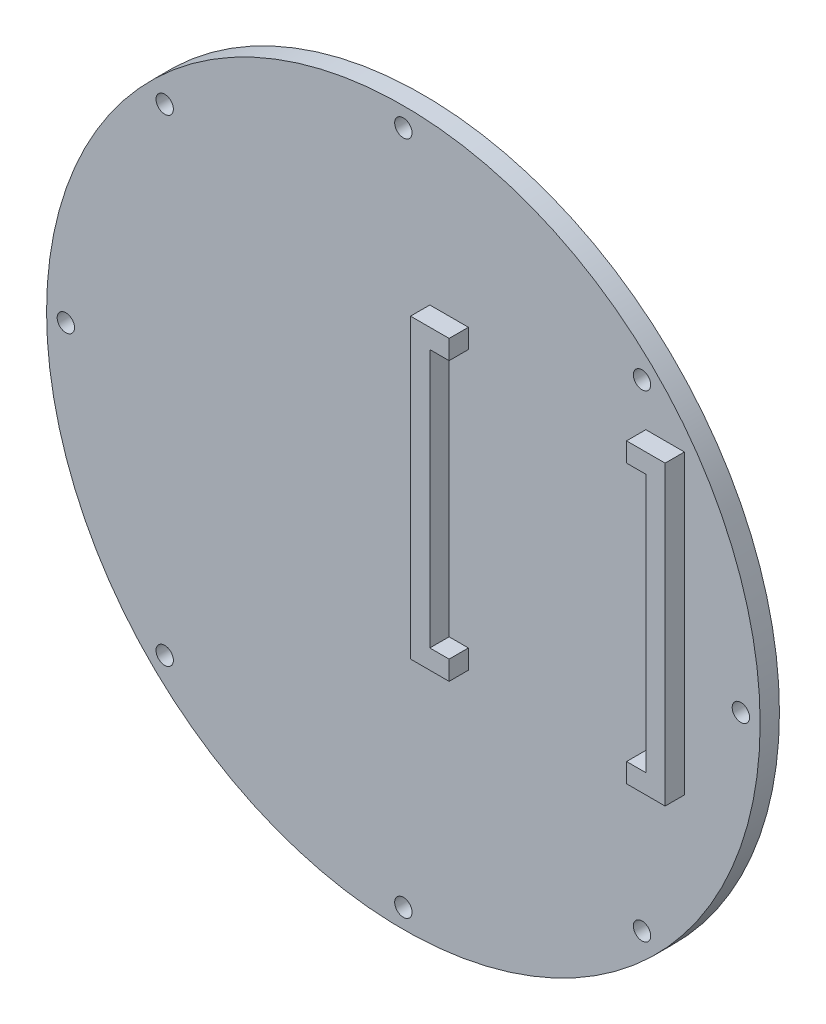
ISO-10303-21;
HEADER;
FILE_DESCRIPTION(('STEP AP214'),'2;1');
FILE_NAME('part.step','',(''),(''),'','','');
FILE_SCHEMA(('AUTOMOTIVE_DESIGN { 1 0 10303 214 1 1 1 1 }'));
ENDSEC;
DATA;
#1=APPLICATION_CONTEXT('core data for automotive mechanical design processes');
#2=APPLICATION_PROTOCOL_DEFINITION('international standard','automotive_design',2000,#1);
#3=PRODUCT_CONTEXT('',#1,'mechanical');
#4=PRODUCT('Part','Part','',(#3));
#5=PRODUCT_RELATED_PRODUCT_CATEGORY('part','',(#4));
#6=PRODUCT_DEFINITION_FORMATION('','',#4);
#7=PRODUCT_DEFINITION_CONTEXT('part definition',#1,'design');
#8=PRODUCT_DEFINITION('design','',#6,#7);
#9=PRODUCT_DEFINITION_SHAPE('','',#8);
#10=(LENGTH_UNIT() NAMED_UNIT(*) SI_UNIT(.MILLI.,.METRE.));
#11=(NAMED_UNIT(*) PLANE_ANGLE_UNIT() SI_UNIT($,.RADIAN.));
#12=(NAMED_UNIT(*) SI_UNIT($,.STERADIAN.) SOLID_ANGLE_UNIT());
#13=UNCERTAINTY_MEASURE_WITH_UNIT(LENGTH_MEASURE(1.E-05),#10,'distance_accuracy_value','');
#14=(GEOMETRIC_REPRESENTATION_CONTEXT(3) GLOBAL_UNCERTAINTY_ASSIGNED_CONTEXT((#13)) GLOBAL_UNIT_ASSIGNED_CONTEXT((#10,
#11,#12)) REPRESENTATION_CONTEXT('',''));
#15=CARTESIAN_POINT('',(0.,0.,0.));
#16=DIRECTION('',(0.,0.,1.));
#17=DIRECTION('',(1.,0.,0.));
#18=AXIS2_PLACEMENT_3D('',#15,#16,#17);
#19=CARTESIAN_POINT('',(0.,0.,5.));
#20=DIRECTION('',(0.,0.,1.));
#21=DIRECTION('',(1.,0.,0.));
#22=AXIS2_PLACEMENT_3D('',#19,#20,#21);
#23=PLANE('',#22);
#24=CARTESIAN_POINT('',(87.5,0.,5.));
#25=DIRECTION('',(0.,0.,1.));
#26=DIRECTION('',(1.,0.,0.));
#27=AXIS2_PLACEMENT_3D('',#24,#25,#26);
#28=CIRCLE('',#27,2.25);
#29=CARTESIAN_POINT('',(89.75,0.,5.));
#30=VERTEX_POINT('',#29);
#31=EDGE_CURVE('E387',#30,#30,#28,.F.);
#32=ORIENTED_EDGE('',*,*,#31,.T.);
#33=EDGE_LOOP('',(#32));
#34=FACE_BOUND('',#33,.T.);
#35=CARTESIAN_POINT('',(61.8718433538228,61.871843353823,5.));
#36=DIRECTION('',(0.,0.,1.));
#37=DIRECTION('',(1.,0.,0.));
#38=AXIS2_PLACEMENT_3D('',#35,#36,#37);
#39=CIRCLE('',#38,2.24999999999999);
#40=CARTESIAN_POINT('',(64.1218433538228,61.871843353823,5.));
#41=VERTEX_POINT('',#40);
#42=EDGE_CURVE('E402',#41,#41,#39,.F.);
#43=ORIENTED_EDGE('',*,*,#42,.T.);
#44=EDGE_LOOP('',(#43));
#45=FACE_BOUND('',#44,.T.);
#46=CARTESIAN_POINT('',(-3.05504617148774E-13,87.5,5.));
#47=DIRECTION('',(0.,0.,1.));
#48=DIRECTION('',(1.,0.,0.));
#49=AXIS2_PLACEMENT_3D('',#46,#47,#48);
#50=CIRCLE('',#49,2.24999999999999);
#51=CARTESIAN_POINT('',(2.24999999999969,87.5,5.));
#52=VERTEX_POINT('',#51);
#53=EDGE_CURVE('E410',#52,#52,#50,.F.);
#54=ORIENTED_EDGE('',*,*,#53,.T.);
#55=EDGE_LOOP('',(#54));
#56=FACE_BOUND('',#55,.T.);
#57=CARTESIAN_POINT('',(-61.8718433538232,61.8718433538226,5.));
#58=DIRECTION('',(0.,0.,1.));
#59=DIRECTION('',(1.,0.,0.));
#60=AXIS2_PLACEMENT_3D('',#57,#58,#59);
#61=CIRCLE('',#60,2.25);
#62=CARTESIAN_POINT('',(-59.6218433538232,61.8718433538226,5.));
#63=VERTEX_POINT('',#62);
#64=EDGE_CURVE('E418',#63,#63,#61,.F.);
#65=ORIENTED_EDGE('',*,*,#64,.T.);
#66=EDGE_LOOP('',(#65));
#67=FACE_BOUND('',#66,.T.);
#68=CARTESIAN_POINT('',(-87.5,-6.11009234297548E-13,5.));
#69=DIRECTION('',(0.,0.,1.));
#70=DIRECTION('',(1.,0.,0.));
#71=AXIS2_PLACEMENT_3D('',#68,#69,#70);
#72=CIRCLE('',#71,2.24999999999999);
#73=CARTESIAN_POINT('',(-85.25,-6.11009234297548E-13,5.));
#74=VERTEX_POINT('',#73);
#75=EDGE_CURVE('E426',#74,#74,#72,.F.);
#76=ORIENTED_EDGE('',*,*,#75,.T.);
#77=EDGE_LOOP('',(#76));
#78=FACE_BOUND('',#77,.T.);
#79=CARTESIAN_POINT('',(-61.8718433538224,-61.8718433538234,5.));
#80=DIRECTION('',(0.,0.,1.));
#81=DIRECTION('',(1.,0.,0.));
#82=AXIS2_PLACEMENT_3D('',#79,#80,#81);
#83=CIRCLE('',#82,2.24999999999999);
#84=CARTESIAN_POINT('',(-59.6218433538224,-61.8718433538234,5.));
#85=VERTEX_POINT('',#84);
#86=EDGE_CURVE('E434',#85,#85,#83,.F.);
#87=ORIENTED_EDGE('',*,*,#86,.T.);
#88=EDGE_LOOP('',(#87));
#89=FACE_BOUND('',#88,.T.);
#90=CARTESIAN_POINT('',(9.16513851446323E-13,-87.5,5.));
#91=DIRECTION('',(0.,0.,1.));
#92=DIRECTION('',(1.,0.,0.));
#93=AXIS2_PLACEMENT_3D('',#90,#91,#92);
#94=CIRCLE('',#93,2.24999999999999);
#95=CARTESIAN_POINT('',(2.25000000000091,-87.5,5.));
#96=VERTEX_POINT('',#95);
#97=EDGE_CURVE('E442',#96,#96,#94,.F.);
#98=ORIENTED_EDGE('',*,*,#97,.T.);
#99=EDGE_LOOP('',(#98));
#100=FACE_BOUND('',#99,.T.);
#101=CARTESIAN_POINT('',(61.8718433538237,-61.8718433538221,5.));
#102=DIRECTION('',(0.,0.,1.));
#103=DIRECTION('',(1.,0.,0.));
#104=AXIS2_PLACEMENT_3D('',#101,#102,#103);
#105=CIRCLE('',#104,2.24999999999999);
#106=CARTESIAN_POINT('',(64.1218433538236,-61.8718433538221,5.));
#107=VERTEX_POINT('',#106);
#108=EDGE_CURVE('E450',#107,#107,#105,.F.);
#109=ORIENTED_EDGE('',*,*,#108,.T.);
#110=EDGE_LOOP('',(#109));
#111=FACE_BOUND('',#110,.T.);
#112=CARTESIAN_POINT('',(0.,0.,5.));
#113=DIRECTION('',(0.,0.,1.));
#114=DIRECTION('',(1.,0.,0.));
#115=AXIS2_PLACEMENT_3D('',#112,#113,#114);
#116=CIRCLE('',#115,92.5);
#117=CARTESIAN_POINT('',(92.5,0.,5.));
#118=VERTEX_POINT('',#117);
#119=EDGE_CURVE('E11',#118,#118,#116,.T.);
#120=ORIENTED_EDGE('',*,*,#119,.T.);
#121=EDGE_LOOP('',(#120));
#122=FACE_BOUND('',#121,.T.);
#123=DIRECTION('',(1.,0.,0.));
#124=VECTOR('',#123,1.);
#125=CARTESIAN_POINT('',(72.8617691082488,-25.8415339502752,5.));
#126=LINE('',#125,#124);
#127=CARTESIAN_POINT('',(62.86176910825,-25.8415339502752,5.));
#128=VERTEX_POINT('',#127);
#129=CARTESIAN_POINT('',(72.8617691082488,-25.8415339502752,5.));
#130=VERTEX_POINT('',#129);
#131=EDGE_CURVE('E186',#128,#130,#126,.T.);
#132=ORIENTED_EDGE('',*,*,#131,.F.);
#133=DIRECTION('',(0.,-1.,0.));
#134=VECTOR('',#133,1.);
#135=CARTESIAN_POINT('',(62.86176910825,-25.8415339502752,5.));
#136=LINE('',#135,#134);
#137=CARTESIAN_POINT('',(62.86176910825,-20.8415339502752,5.));
#138=VERTEX_POINT('',#137);
#139=EDGE_CURVE('E181',#138,#128,#136,.T.);
#140=ORIENTED_EDGE('',*,*,#139,.F.);
#141=DIRECTION('',(-1.,0.,0.));
#142=VECTOR('',#141,1.);
#143=CARTESIAN_POINT('',(62.86176910825,-20.8415339502752,5.));
#144=LINE('',#143,#142);
#145=CARTESIAN_POINT('',(67.8617691082496,-20.8415339502752,5.));
#146=VERTEX_POINT('',#145);
#147=EDGE_CURVE('E197',#146,#138,#144,.T.);
#148=ORIENTED_EDGE('',*,*,#147,.F.);
#149=DIRECTION('',(0.,-1.,0.));
#150=VECTOR('',#149,1.);
#151=CARTESIAN_POINT('',(67.8617691082496,46.1584660497248,5.));
#152=LINE('',#151,#150);
#153=CARTESIAN_POINT('',(67.8617691082496,46.1584660497248,5.));
#154=VERTEX_POINT('',#153);
#155=EDGE_CURVE('E233',#154,#146,#152,.T.);
#156=ORIENTED_EDGE('',*,*,#155,.F.);
#157=DIRECTION('',(1.,0.,0.));
#158=VECTOR('',#157,1.);
#159=CARTESIAN_POINT('',(67.8617691082496,46.1584660497248,5.));
#160=LINE('',#159,#158);
#161=CARTESIAN_POINT('',(62.86176910825,46.1584660497248,5.));
#162=VERTEX_POINT('',#161);
#163=EDGE_CURVE('E230',#162,#154,#160,.T.);
#164=ORIENTED_EDGE('',*,*,#163,.F.);
#165=DIRECTION('',(0.,-1.,0.));
#166=VECTOR('',#165,1.);
#167=CARTESIAN_POINT('',(62.86176910825,46.1584660497248,5.));
#168=LINE('',#167,#166);
#169=CARTESIAN_POINT('',(62.86176910825,51.1584660497248,5.));
#170=VERTEX_POINT('',#169);
#171=EDGE_CURVE('E227',#170,#162,#168,.T.);
#172=ORIENTED_EDGE('',*,*,#171,.F.);
#173=DIRECTION('',(-1.,0.,0.));
#174=VECTOR('',#173,1.);
#175=CARTESIAN_POINT('',(62.86176910825,51.1584660497248,5.));
#176=LINE('',#175,#174);
#177=CARTESIAN_POINT('',(72.8617691082488,51.1584660497248,5.));
#178=VERTEX_POINT('',#177);
#179=EDGE_CURVE('E224',#178,#170,#176,.T.);
#180=ORIENTED_EDGE('',*,*,#179,.F.);
#181=DIRECTION('',(0.,1.,0.));
#182=VECTOR('',#181,1.);
#183=CARTESIAN_POINT('',(72.8617691082488,51.1584660497248,5.));
#184=LINE('',#183,#182);
#185=EDGE_CURVE('E221',#130,#178,#184,.T.);
#186=ORIENTED_EDGE('',*,*,#185,.F.);
#187=EDGE_LOOP('',(#132,#140,#148,#156,#164,#172,#180,#186));
#188=FACE_BOUND('',#187,.T.);
#189=DIRECTION('',(0.,1.,0.));
#190=VECTOR('',#189,1.);
#191=CARTESIAN_POINT('',(11.8617691047419,46.1584660497248,5.));
#192=LINE('',#191,#190);
#193=CARTESIAN_POINT('',(11.8617691047419,-20.8415339502752,5.));
#194=VERTEX_POINT('',#193);
#195=CARTESIAN_POINT('',(11.8617691047419,46.1584660497248,5.));
#196=VERTEX_POINT('',#195);
#197=EDGE_CURVE('E394',#194,#196,#192,.T.);
#198=ORIENTED_EDGE('',*,*,#197,.F.);
#199=DIRECTION('',(-1.,0.,0.));
#200=VECTOR('',#199,1.);
#201=CARTESIAN_POINT('',(16.8617691047416,-20.8415339502752,5.));
#202=LINE('',#201,#200);
#203=CARTESIAN_POINT('',(16.8617691047416,-20.8415339502752,5.));
#204=VERTEX_POINT('',#203);
#205=EDGE_CURVE('E178',#204,#194,#202,.T.);
#206=ORIENTED_EDGE('',*,*,#205,.F.);
#207=DIRECTION('',(0.,1.,0.));
#208=VECTOR('',#207,1.);
#209=CARTESIAN_POINT('',(16.8617691047416,-25.8415339502752,5.));
#210=LINE('',#209,#208);
#211=CARTESIAN_POINT('',(16.8617691047416,-25.8415339502752,5.));
#212=VERTEX_POINT('',#211);
#213=EDGE_CURVE('E174',#212,#204,#210,.T.);
#214=ORIENTED_EDGE('',*,*,#213,.F.);
#215=DIRECTION('',(1.,0.,0.));
#216=VECTOR('',#215,1.);
#217=CARTESIAN_POINT('',(6.86176910474275,-25.8415339502752,5.));
#218=LINE('',#217,#216);
#219=CARTESIAN_POINT('',(6.86176910474275,-25.8415339502752,5.));
#220=VERTEX_POINT('',#219);
#221=EDGE_CURVE('E485',#220,#212,#218,.T.);
#222=ORIENTED_EDGE('',*,*,#221,.F.);
#223=DIRECTION('',(0.,-1.,0.));
#224=VECTOR('',#223,1.);
#225=CARTESIAN_POINT('',(6.86176910474275,51.1584660497248,5.));
#226=LINE('',#225,#224);
#227=CARTESIAN_POINT('',(6.86176910474275,51.1584660497248,5.));
#228=VERTEX_POINT('',#227);
#229=EDGE_CURVE('E482',#228,#220,#226,.T.);
#230=ORIENTED_EDGE('',*,*,#229,.F.);
#231=DIRECTION('',(-1.,0.,0.));
#232=VECTOR('',#231,1.);
#233=CARTESIAN_POINT('',(16.8617691047416,51.1584660497248,5.));
#234=LINE('',#233,#232);
#235=CARTESIAN_POINT('',(16.8617691047416,51.1584660497248,5.));
#236=VERTEX_POINT('',#235);
#237=EDGE_CURVE('E479',#236,#228,#234,.T.);
#238=ORIENTED_EDGE('',*,*,#237,.F.);
#239=DIRECTION('',(0.,1.,0.));
#240=VECTOR('',#239,1.);
#241=CARTESIAN_POINT('',(16.8617691047416,46.1584660497248,5.));
#242=LINE('',#241,#240);
#243=CARTESIAN_POINT('',(16.8617691047416,46.1584660497248,5.));
#244=VERTEX_POINT('',#243);
#245=EDGE_CURVE('E476',#244,#236,#242,.T.);
#246=ORIENTED_EDGE('',*,*,#245,.F.);
#247=DIRECTION('',(1.,0.,0.));
#248=VECTOR('',#247,1.);
#249=CARTESIAN_POINT('',(11.8617691047419,46.1584660497248,5.));
#250=LINE('',#249,#248);
#251=EDGE_CURVE('E473',#196,#244,#250,.T.);
#252=ORIENTED_EDGE('',*,*,#251,.F.);
#253=EDGE_LOOP('',(#198,#206,#214,#222,#230,#238,#246,#252));
#254=FACE_BOUND('',#253,.T.);
#255=ADVANCED_FACE('F38',(#34,#45,#56,#67,#78,#89,#100,#111,#122,#188,#254),#23,.T.);
#256=CARTESIAN_POINT('',(0.,0.,5.));
#257=DIRECTION('',(0.,0.,-1.));
#258=DIRECTION('',(-1.,0.,0.));
#259=AXIS2_PLACEMENT_3D('',#256,#257,#258);
#260=CYLINDRICAL_SURFACE('',#259,92.5);
#261=ORIENTED_EDGE('',*,*,#119,.F.);
#262=EDGE_LOOP('',(#261));
#263=FACE_BOUND('',#262,.T.);
#264=CARTESIAN_POINT('',(0.,0.,0.));
#265=DIRECTION('',(0.,0.,1.));
#266=DIRECTION('',(1.,0.,0.));
#267=AXIS2_PLACEMENT_3D('',#264,#265,#266);
#268=CIRCLE('',#267,92.5);
#269=CARTESIAN_POINT('',(92.5,0.,0.));
#270=VERTEX_POINT('',#269);
#271=EDGE_CURVE('E42',#270,#270,#268,.T.);
#272=ORIENTED_EDGE('',*,*,#271,.T.);
#273=EDGE_LOOP('',(#272));
#274=FACE_BOUND('',#273,.T.);
#275=ADVANCED_FACE('F40',(#263,#274),#260,.T.);
#276=CARTESIAN_POINT('',(0.,0.,0.));
#277=DIRECTION('',(0.,0.,1.));
#278=DIRECTION('',(1.,0.,0.));
#279=AXIS2_PLACEMENT_3D('',#276,#277,#278);
#280=PLANE('',#279);
#281=CARTESIAN_POINT('',(87.5,0.,0.));
#282=DIRECTION('',(0.,0.,-1.));
#283=DIRECTION('',(-1.,0.,0.));
#284=AXIS2_PLACEMENT_3D('',#281,#282,#283);
#285=CIRCLE('',#284,2.25);
#286=CARTESIAN_POINT('',(85.25,0.,0.));
#287=VERTEX_POINT('',#286);
#288=EDGE_CURVE('E389',#287,#287,#285,.T.);
#289=ORIENTED_EDGE('',*,*,#288,.F.);
#290=EDGE_LOOP('',(#289));
#291=FACE_BOUND('',#290,.T.);
#292=CARTESIAN_POINT('',(61.8718433538228,61.871843353823,0.));
#293=DIRECTION('',(0.,0.,-1.));
#294=DIRECTION('',(-1.,0.,0.));
#295=AXIS2_PLACEMENT_3D('',#292,#293,#294);
#296=CIRCLE('',#295,2.24999999999999);
#297=CARTESIAN_POINT('',(59.6218433538228,61.871843353823,0.));
#298=VERTEX_POINT('',#297);
#299=EDGE_CURVE('E396',#298,#298,#296,.T.);
#300=ORIENTED_EDGE('',*,*,#299,.F.);
#301=EDGE_LOOP('',(#300));
#302=FACE_BOUND('',#301,.T.);
#303=CARTESIAN_POINT('',(-3.05504617148774E-13,87.5,0.));
#304=DIRECTION('',(0.,0.,-1.));
#305=DIRECTION('',(-1.,0.,0.));
#306=AXIS2_PLACEMENT_3D('',#303,#304,#305);
#307=CIRCLE('',#306,2.24999999999999);
#308=CARTESIAN_POINT('',(-2.2500000000003,87.5,0.));
#309=VERTEX_POINT('',#308);
#310=EDGE_CURVE('E406',#309,#309,#307,.T.);
#311=ORIENTED_EDGE('',*,*,#310,.F.);
#312=EDGE_LOOP('',(#311));
#313=FACE_BOUND('',#312,.T.);
#314=CARTESIAN_POINT('',(-61.8718433538232,61.8718433538226,0.));
#315=DIRECTION('',(0.,0.,-1.));
#316=DIRECTION('',(-1.,0.,0.));
#317=AXIS2_PLACEMENT_3D('',#314,#315,#316);
#318=CIRCLE('',#317,2.25);
#319=CARTESIAN_POINT('',(-64.1218433538232,61.8718433538226,0.));
#320=VERTEX_POINT('',#319);
#321=EDGE_CURVE('E414',#320,#320,#318,.T.);
#322=ORIENTED_EDGE('',*,*,#321,.F.);
#323=EDGE_LOOP('',(#322));
#324=FACE_BOUND('',#323,.T.);
#325=CARTESIAN_POINT('',(-87.5,-6.11009234297548E-13,0.));
#326=DIRECTION('',(0.,0.,-1.));
#327=DIRECTION('',(-1.,0.,0.));
#328=AXIS2_PLACEMENT_3D('',#325,#326,#327);
#329=CIRCLE('',#328,2.24999999999999);
#330=CARTESIAN_POINT('',(-89.75,-6.11009234297548E-13,0.));
#331=VERTEX_POINT('',#330);
#332=EDGE_CURVE('E422',#331,#331,#329,.T.);
#333=ORIENTED_EDGE('',*,*,#332,.F.);
#334=EDGE_LOOP('',(#333));
#335=FACE_BOUND('',#334,.T.);
#336=CARTESIAN_POINT('',(-61.8718433538224,-61.8718433538234,0.));
#337=DIRECTION('',(0.,0.,-1.));
#338=DIRECTION('',(-1.,0.,0.));
#339=AXIS2_PLACEMENT_3D('',#336,#337,#338);
#340=CIRCLE('',#339,2.24999999999999);
#341=CARTESIAN_POINT('',(-64.1218433538223,-61.8718433538234,0.));
#342=VERTEX_POINT('',#341);
#343=EDGE_CURVE('E430',#342,#342,#340,.T.);
#344=ORIENTED_EDGE('',*,*,#343,.F.);
#345=EDGE_LOOP('',(#344));
#346=FACE_BOUND('',#345,.T.);
#347=CARTESIAN_POINT('',(9.16513851446323E-13,-87.5,0.));
#348=DIRECTION('',(0.,0.,-1.));
#349=DIRECTION('',(-1.,0.,0.));
#350=AXIS2_PLACEMENT_3D('',#347,#348,#349);
#351=CIRCLE('',#350,2.24999999999999);
#352=CARTESIAN_POINT('',(-2.24999999999907,-87.5,0.));
#353=VERTEX_POINT('',#352);
#354=EDGE_CURVE('E438',#353,#353,#351,.T.);
#355=ORIENTED_EDGE('',*,*,#354,.F.);
#356=EDGE_LOOP('',(#355));
#357=FACE_BOUND('',#356,.T.);
#358=CARTESIAN_POINT('',(61.8718433538237,-61.8718433538221,0.));
#359=DIRECTION('',(0.,0.,-1.));
#360=DIRECTION('',(-1.,0.,0.));
#361=AXIS2_PLACEMENT_3D('',#358,#359,#360);
#362=CIRCLE('',#361,2.24999999999999);
#363=CARTESIAN_POINT('',(59.6218433538237,-61.8718433538221,0.));
#364=VERTEX_POINT('',#363);
#365=EDGE_CURVE('E446',#364,#364,#362,.T.);
#366=ORIENTED_EDGE('',*,*,#365,.F.);
#367=EDGE_LOOP('',(#366));
#368=FACE_BOUND('',#367,.T.);
#369=ORIENTED_EDGE('',*,*,#271,.F.);
#370=EDGE_LOOP('',(#369));
#371=FACE_BOUND('',#370,.T.);
#372=ADVANCED_FACE('F272',(#291,#302,#313,#324,#335,#346,#357,#368,#371),#280,.F.);
#373=CARTESIAN_POINT('',(62.86176910825,-25.8415339502752,10.));
#374=DIRECTION('',(1.,0.,0.));
#375=DIRECTION('',(0.,1.,0.));
#376=AXIS2_PLACEMENT_3D('',#373,#374,#375);
#377=PLANE('',#376);
#378=ORIENTED_EDGE('',*,*,#139,.T.);
#379=DIRECTION('',(0.,0.,-1.));
#380=VECTOR('',#379,1.);
#381=CARTESIAN_POINT('',(62.86176910825,-25.8415339502752,10.));
#382=LINE('',#381,#380);
#383=CARTESIAN_POINT('',(62.86176910825,-25.8415339502752,10.));
#384=VERTEX_POINT('',#383);
#385=EDGE_CURVE('E263',#384,#128,#382,.T.);
#386=ORIENTED_EDGE('',*,*,#385,.F.);
#387=DIRECTION('',(0.,-1.,0.));
#388=VECTOR('',#387,1.);
#389=CARTESIAN_POINT('',(62.86176910825,-25.8415339502752,10.));
#390=LINE('',#389,#388);
#391=CARTESIAN_POINT('',(62.86176910825,-20.8415339502752,10.));
#392=VERTEX_POINT('',#391);
#393=EDGE_CURVE('E192',#392,#384,#390,.T.);
#394=ORIENTED_EDGE('',*,*,#393,.F.);
#395=DIRECTION('',(0.,0.,-1.));
#396=VECTOR('',#395,1.);
#397=CARTESIAN_POINT('',(62.86176910825,-20.8415339502752,10.));
#398=LINE('',#397,#396);
#399=EDGE_CURVE('E217',#392,#138,#398,.T.);
#400=ORIENTED_EDGE('',*,*,#399,.T.);
#401=EDGE_LOOP('',(#378,#386,#394,#400));
#402=FACE_BOUND('',#401,.T.);
#403=ADVANCED_FACE('F274',(#402),#377,.F.);
#404=CARTESIAN_POINT('',(72.8617691082488,-25.8415339502752,10.));
#405=DIRECTION('',(0.,1.,0.));
#406=DIRECTION('',(0.,0.,1.));
#407=AXIS2_PLACEMENT_3D('',#404,#405,#406);
#408=PLANE('',#407);
#409=ORIENTED_EDGE('',*,*,#131,.T.);
#410=DIRECTION('',(0.,0.,-1.));
#411=VECTOR('',#410,1.);
#412=CARTESIAN_POINT('',(72.8617691082488,-25.8415339502752,10.));
#413=LINE('',#412,#411);
#414=CARTESIAN_POINT('',(72.8617691082488,-25.8415339502752,10.));
#415=VERTEX_POINT('',#414);
#416=EDGE_CURVE('E259',#415,#130,#413,.T.);
#417=ORIENTED_EDGE('',*,*,#416,.F.);
#418=DIRECTION('',(1.,0.,0.));
#419=VECTOR('',#418,1.);
#420=CARTESIAN_POINT('',(72.8617691082488,-25.8415339502752,10.));
#421=LINE('',#420,#419);
#422=EDGE_CURVE('E196',#384,#415,#421,.T.);
#423=ORIENTED_EDGE('',*,*,#422,.F.);
#424=ORIENTED_EDGE('',*,*,#385,.T.);
#425=EDGE_LOOP('',(#409,#417,#423,#424));
#426=FACE_BOUND('',#425,.T.);
#427=ADVANCED_FACE('F280',(#426),#408,.F.);
#428=CARTESIAN_POINT('',(72.8617691082488,51.1584660497248,10.));
#429=DIRECTION('',(-1.,0.,0.));
#430=DIRECTION('',(0.,0.,1.));
#431=AXIS2_PLACEMENT_3D('',#428,#429,#430);
#432=PLANE('',#431);
#433=ORIENTED_EDGE('',*,*,#185,.T.);
#434=DIRECTION('',(0.,0.,-1.));
#435=VECTOR('',#434,1.);
#436=CARTESIAN_POINT('',(72.8617691082488,51.1584660497248,10.));
#437=LINE('',#436,#435);
#438=CARTESIAN_POINT('',(72.8617691082488,51.1584660497248,10.));
#439=VERTEX_POINT('',#438);
#440=EDGE_CURVE('E255',#439,#178,#437,.T.);
#441=ORIENTED_EDGE('',*,*,#440,.F.);
#442=DIRECTION('',(0.,1.,0.));
#443=VECTOR('',#442,1.);
#444=CARTESIAN_POINT('',(72.8617691082488,51.1584660497248,10.));
#445=LINE('',#444,#443);
#446=EDGE_CURVE('E200',#415,#439,#445,.T.);
#447=ORIENTED_EDGE('',*,*,#446,.F.);
#448=ORIENTED_EDGE('',*,*,#416,.T.);
#449=EDGE_LOOP('',(#433,#441,#447,#448));
#450=FACE_BOUND('',#449,.T.);
#451=ADVANCED_FACE('F296',(#450),#432,.F.);
#452=CARTESIAN_POINT('',(62.86176910825,51.1584660497248,10.));
#453=DIRECTION('',(0.,-1.,0.));
#454=DIRECTION('',(0.,0.,-1.));
#455=AXIS2_PLACEMENT_3D('',#452,#453,#454);
#456=PLANE('',#455);
#457=ORIENTED_EDGE('',*,*,#179,.T.);
#458=DIRECTION('',(0.,0.,-1.));
#459=VECTOR('',#458,1.);
#460=CARTESIAN_POINT('',(62.86176910825,51.1584660497248,10.));
#461=LINE('',#460,#459);
#462=CARTESIAN_POINT('',(62.86176910825,51.1584660497248,10.));
#463=VERTEX_POINT('',#462);
#464=EDGE_CURVE('E251',#463,#170,#461,.T.);
#465=ORIENTED_EDGE('',*,*,#464,.F.);
#466=DIRECTION('',(-1.,0.,0.));
#467=VECTOR('',#466,1.);
#468=CARTESIAN_POINT('',(62.86176910825,51.1584660497248,10.));
#469=LINE('',#468,#467);
#470=EDGE_CURVE('E203',#439,#463,#469,.T.);
#471=ORIENTED_EDGE('',*,*,#470,.F.);
#472=ORIENTED_EDGE('',*,*,#440,.T.);
#473=EDGE_LOOP('',(#457,#465,#471,#472));
#474=FACE_BOUND('',#473,.T.);
#475=ADVANCED_FACE('F299',(#474),#456,.F.);
#476=CARTESIAN_POINT('',(62.86176910825,46.1584660497248,10.));
#477=DIRECTION('',(1.,0.,0.));
#478=DIRECTION('',(0.,1.,0.));
#479=AXIS2_PLACEMENT_3D('',#476,#477,#478);
#480=PLANE('',#479);
#481=ORIENTED_EDGE('',*,*,#171,.T.);
#482=DIRECTION('',(0.,0.,-1.));
#483=VECTOR('',#482,1.);
#484=CARTESIAN_POINT('',(62.86176910825,46.1584660497248,10.));
#485=LINE('',#484,#483);
#486=CARTESIAN_POINT('',(62.86176910825,46.1584660497248,10.));
#487=VERTEX_POINT('',#486);
#488=EDGE_CURVE('E247',#487,#162,#485,.T.);
#489=ORIENTED_EDGE('',*,*,#488,.F.);
#490=DIRECTION('',(0.,-1.,0.));
#491=VECTOR('',#490,1.);
#492=CARTESIAN_POINT('',(62.86176910825,46.1584660497248,10.));
#493=LINE('',#492,#491);
#494=EDGE_CURVE('E206',#463,#487,#493,.T.);
#495=ORIENTED_EDGE('',*,*,#494,.F.);
#496=ORIENTED_EDGE('',*,*,#464,.T.);
#497=EDGE_LOOP('',(#481,#489,#495,#496));
#498=FACE_BOUND('',#497,.T.);
#499=ADVANCED_FACE('F303',(#498),#480,.F.);
#500=CARTESIAN_POINT('',(67.8617691082496,46.1584660497248,10.));
#501=DIRECTION('',(0.,1.,0.));
#502=DIRECTION('',(-1.,0.,0.));
#503=AXIS2_PLACEMENT_3D('',#500,#501,#502);
#504=PLANE('',#503);
#505=ORIENTED_EDGE('',*,*,#163,.T.);
#506=DIRECTION('',(0.,0.,-1.));
#507=VECTOR('',#506,1.);
#508=CARTESIAN_POINT('',(67.8617691082496,46.1584660497248,10.));
#509=LINE('',#508,#507);
#510=CARTESIAN_POINT('',(67.8617691082496,46.1584660497248,10.));
#511=VERTEX_POINT('',#510);
#512=EDGE_CURVE('E243',#511,#154,#509,.T.);
#513=ORIENTED_EDGE('',*,*,#512,.F.);
#514=DIRECTION('',(1.,0.,0.));
#515=VECTOR('',#514,1.);
#516=CARTESIAN_POINT('',(67.8617691082496,46.1584660497248,10.));
#517=LINE('',#516,#515);
#518=EDGE_CURVE('E209',#487,#511,#517,.T.);
#519=ORIENTED_EDGE('',*,*,#518,.F.);
#520=ORIENTED_EDGE('',*,*,#488,.T.);
#521=EDGE_LOOP('',(#505,#513,#519,#520));
#522=FACE_BOUND('',#521,.T.);
#523=ADVANCED_FACE('F307',(#522),#504,.F.);
#524=CARTESIAN_POINT('',(67.8617691082496,46.1584660497248,10.));
#525=DIRECTION('',(1.,0.,0.));
#526=DIRECTION('',(0.,0.,-1.));
#527=AXIS2_PLACEMENT_3D('',#524,#525,#526);
#528=PLANE('',#527);
#529=ORIENTED_EDGE('',*,*,#155,.T.);
#530=DIRECTION('',(0.,0.,-1.));
#531=VECTOR('',#530,1.);
#532=CARTESIAN_POINT('',(67.8617691082496,-20.8415339502752,10.));
#533=LINE('',#532,#531);
#534=CARTESIAN_POINT('',(67.8617691082496,-20.8415339502752,10.));
#535=VERTEX_POINT('',#534);
#536=EDGE_CURVE('E62',#535,#146,#533,.T.);
#537=ORIENTED_EDGE('',*,*,#536,.F.);
#538=DIRECTION('',(0.,-1.,0.));
#539=VECTOR('',#538,1.);
#540=CARTESIAN_POINT('',(67.8617691082496,46.1584660497248,10.));
#541=LINE('',#540,#539);
#542=EDGE_CURVE('E212',#511,#535,#541,.T.);
#543=ORIENTED_EDGE('',*,*,#542,.F.);
#544=ORIENTED_EDGE('',*,*,#512,.T.);
#545=EDGE_LOOP('',(#529,#537,#543,#544));
#546=FACE_BOUND('',#545,.T.);
#547=ADVANCED_FACE('F311',(#546),#528,.F.);
#548=CARTESIAN_POINT('',(62.86176910825,-20.8415339502752,10.));
#549=DIRECTION('',(0.,-1.,0.));
#550=DIRECTION('',(1.,0.,0.));
#551=AXIS2_PLACEMENT_3D('',#548,#549,#550);
#552=PLANE('',#551);
#553=ORIENTED_EDGE('',*,*,#147,.T.);
#554=ORIENTED_EDGE('',*,*,#399,.F.);
#555=DIRECTION('',(-1.,0.,0.));
#556=VECTOR('',#555,1.);
#557=CARTESIAN_POINT('',(62.86176910825,-20.8415339502752,10.));
#558=LINE('',#557,#556);
#559=EDGE_CURVE('E215',#535,#392,#558,.T.);
#560=ORIENTED_EDGE('',*,*,#559,.F.);
#561=ORIENTED_EDGE('',*,*,#536,.T.);
#562=EDGE_LOOP('',(#553,#554,#560,#561));
#563=FACE_BOUND('',#562,.T.);
#564=ADVANCED_FACE('F315',(#563),#552,.F.);
#565=CARTESIAN_POINT('',(0.,0.,10.));
#566=DIRECTION('',(0.,0.,-1.));
#567=DIRECTION('',(-1.,0.,0.));
#568=AXIS2_PLACEMENT_3D('',#565,#566,#567);
#569=PLANE('',#568);
#570=ORIENTED_EDGE('',*,*,#393,.T.);
#571=ORIENTED_EDGE('',*,*,#422,.T.);
#572=ORIENTED_EDGE('',*,*,#446,.T.);
#573=ORIENTED_EDGE('',*,*,#470,.T.);
#574=ORIENTED_EDGE('',*,*,#494,.T.);
#575=ORIENTED_EDGE('',*,*,#518,.T.);
#576=ORIENTED_EDGE('',*,*,#542,.T.);
#577=ORIENTED_EDGE('',*,*,#559,.T.);
#578=EDGE_LOOP('',(#570,#571,#572,#573,#574,#575,#576,#577));
#579=FACE_BOUND('',#578,.T.);
#580=ADVANCED_FACE('F319',(#579),#569,.F.);
#581=CARTESIAN_POINT('',(16.8617691047416,-20.8415339502752,10.));
#582=DIRECTION('',(0.,-1.,0.));
#583=DIRECTION('',(1.,0.,0.));
#584=AXIS2_PLACEMENT_3D('',#581,#582,#583);
#585=PLANE('',#584);
#586=ORIENTED_EDGE('',*,*,#205,.T.);
#587=DIRECTION('',(0.,0.,-1.));
#588=VECTOR('',#587,1.);
#589=CARTESIAN_POINT('',(11.8617691047419,-20.8415339502752,10.));
#590=LINE('',#589,#588);
#591=CARTESIAN_POINT('',(11.8617691047419,-20.8415339502752,10.));
#592=VERTEX_POINT('',#591);
#593=EDGE_CURVE('E157',#592,#194,#590,.T.);
#594=ORIENTED_EDGE('',*,*,#593,.F.);
#595=DIRECTION('',(-1.,0.,0.));
#596=VECTOR('',#595,1.);
#597=CARTESIAN_POINT('',(16.8617691047416,-20.8415339502752,10.));
#598=LINE('',#597,#596);
#599=CARTESIAN_POINT('',(16.8617691047416,-20.8415339502752,10.));
#600=VERTEX_POINT('',#599);
#601=EDGE_CURVE('E165',#600,#592,#598,.T.);
#602=ORIENTED_EDGE('',*,*,#601,.F.);
#603=DIRECTION('',(0.,0.,-1.));
#604=VECTOR('',#603,1.);
#605=CARTESIAN_POINT('',(16.8617691047416,-20.8415339502752,10.));
#606=LINE('',#605,#604);
#607=EDGE_CURVE('E469',#600,#204,#606,.T.);
#608=ORIENTED_EDGE('',*,*,#607,.T.);
#609=EDGE_LOOP('',(#586,#594,#602,#608));
#610=FACE_BOUND('',#609,.T.);
#611=ADVANCED_FACE('F176',(#610),#585,.F.);
#612=CARTESIAN_POINT('',(11.8617691047419,46.1584660497248,10.));
#613=DIRECTION('',(-1.,0.,0.));
#614=DIRECTION('',(0.,-1.,0.));
#615=AXIS2_PLACEMENT_3D('',#612,#613,#614);
#616=PLANE('',#615);
#617=ORIENTED_EDGE('',*,*,#197,.T.);
#618=DIRECTION('',(0.,0.,-1.));
#619=VECTOR('',#618,1.);
#620=CARTESIAN_POINT('',(11.8617691047419,46.1584660497248,10.));
#621=LINE('',#620,#619);
#622=CARTESIAN_POINT('',(11.8617691047419,46.1584660497248,10.));
#623=VERTEX_POINT('',#622);
#624=EDGE_CURVE('E160',#623,#196,#621,.T.);
#625=ORIENTED_EDGE('',*,*,#624,.F.);
#626=DIRECTION('',(0.,1.,0.));
#627=VECTOR('',#626,1.);
#628=CARTESIAN_POINT('',(11.8617691047419,46.1584660497248,10.));
#629=LINE('',#628,#627);
#630=EDGE_CURVE('E153',#592,#623,#629,.T.);
#631=ORIENTED_EDGE('',*,*,#630,.F.);
#632=ORIENTED_EDGE('',*,*,#593,.T.);
#633=EDGE_LOOP('',(#617,#625,#631,#632));
#634=FACE_BOUND('',#633,.T.);
#635=ADVANCED_FACE('F155',(#634),#616,.F.);
#636=CARTESIAN_POINT('',(11.8617691047419,46.1584660497248,10.));
#637=DIRECTION('',(0.,1.,0.));
#638=DIRECTION('',(-1.,0.,0.));
#639=AXIS2_PLACEMENT_3D('',#636,#637,#638);
#640=PLANE('',#639);
#641=ORIENTED_EDGE('',*,*,#251,.T.);
#642=DIRECTION('',(0.,0.,-1.));
#643=VECTOR('',#642,1.);
#644=CARTESIAN_POINT('',(16.8617691047416,46.1584660497248,10.));
#645=LINE('',#644,#643);
#646=CARTESIAN_POINT('',(16.8617691047416,46.1584660497248,10.));
#647=VERTEX_POINT('',#646);
#648=EDGE_CURVE('E188',#647,#244,#645,.T.);
#649=ORIENTED_EDGE('',*,*,#648,.F.);
#650=DIRECTION('',(1.,0.,0.));
#651=VECTOR('',#650,1.);
#652=CARTESIAN_POINT('',(11.8617691047419,46.1584660497248,10.));
#653=LINE('',#652,#651);
#654=EDGE_CURVE('E164',#623,#647,#653,.T.);
#655=ORIENTED_EDGE('',*,*,#654,.F.);
#656=ORIENTED_EDGE('',*,*,#624,.T.);
#657=EDGE_LOOP('',(#641,#649,#655,#656));
#658=FACE_BOUND('',#657,.T.);
#659=ADVANCED_FACE('F327',(#658),#640,.F.);
#660=CARTESIAN_POINT('',(16.8617691047416,46.1584660497248,10.));
#661=DIRECTION('',(-1.,0.,0.));
#662=DIRECTION('',(0.,0.,1.));
#663=AXIS2_PLACEMENT_3D('',#660,#661,#662);
#664=PLANE('',#663);
#665=ORIENTED_EDGE('',*,*,#245,.T.);
#666=DIRECTION('',(0.,0.,-1.));
#667=VECTOR('',#666,1.);
#668=CARTESIAN_POINT('',(16.8617691047416,51.1584660497248,10.));
#669=LINE('',#668,#667);
#670=CARTESIAN_POINT('',(16.8617691047416,51.1584660497248,10.));
#671=VERTEX_POINT('',#670);
#672=EDGE_CURVE('E502',#671,#236,#669,.T.);
#673=ORIENTED_EDGE('',*,*,#672,.F.);
#674=DIRECTION('',(0.,1.,0.));
#675=VECTOR('',#674,1.);
#676=CARTESIAN_POINT('',(16.8617691047416,46.1584660497248,10.));
#677=LINE('',#676,#675);
#678=EDGE_CURVE('E456',#647,#671,#677,.T.);
#679=ORIENTED_EDGE('',*,*,#678,.F.);
#680=ORIENTED_EDGE('',*,*,#648,.T.);
#681=EDGE_LOOP('',(#665,#673,#679,#680));
#682=FACE_BOUND('',#681,.T.);
#683=ADVANCED_FACE('F330',(#682),#664,.F.);
#684=CARTESIAN_POINT('',(16.8617691047416,51.1584660497248,10.));
#685=DIRECTION('',(0.,-1.,0.));
#686=DIRECTION('',(0.,0.,-1.));
#687=AXIS2_PLACEMENT_3D('',#684,#685,#686);
#688=PLANE('',#687);
#689=ORIENTED_EDGE('',*,*,#237,.T.);
#690=DIRECTION('',(0.,0.,-1.));
#691=VECTOR('',#690,1.);
#692=CARTESIAN_POINT('',(6.86176910474275,51.1584660497248,10.));
#693=LINE('',#692,#691);
#694=CARTESIAN_POINT('',(6.86176910474275,51.1584660497248,10.));
#695=VERTEX_POINT('',#694);
#696=EDGE_CURVE('E498',#695,#228,#693,.T.);
#697=ORIENTED_EDGE('',*,*,#696,.F.);
#698=DIRECTION('',(-1.,0.,0.));
#699=VECTOR('',#698,1.);
#700=CARTESIAN_POINT('',(16.8617691047416,51.1584660497248,10.));
#701=LINE('',#700,#699);
#702=EDGE_CURVE('E459',#671,#695,#701,.T.);
#703=ORIENTED_EDGE('',*,*,#702,.F.);
#704=ORIENTED_EDGE('',*,*,#672,.T.);
#705=EDGE_LOOP('',(#689,#697,#703,#704));
#706=FACE_BOUND('',#705,.T.);
#707=ADVANCED_FACE('F334',(#706),#688,.F.);
#708=CARTESIAN_POINT('',(6.86176910474275,51.1584660497248,10.));
#709=DIRECTION('',(1.,0.,0.));
#710=DIRECTION('',(0.,0.,-1.));
#711=AXIS2_PLACEMENT_3D('',#708,#709,#710);
#712=PLANE('',#711);
#713=ORIENTED_EDGE('',*,*,#229,.T.);
#714=DIRECTION('',(0.,0.,-1.));
#715=VECTOR('',#714,1.);
#716=CARTESIAN_POINT('',(6.86176910474275,-25.8415339502752,10.));
#717=LINE('',#716,#715);
#718=CARTESIAN_POINT('',(6.86176910474275,-25.8415339502752,10.));
#719=VERTEX_POINT('',#718);
#720=EDGE_CURVE('E494',#719,#220,#717,.T.);
#721=ORIENTED_EDGE('',*,*,#720,.F.);
#722=DIRECTION('',(0.,-1.,0.));
#723=VECTOR('',#722,1.);
#724=CARTESIAN_POINT('',(6.86176910474275,51.1584660497248,10.));
#725=LINE('',#724,#723);
#726=EDGE_CURVE('E462',#695,#719,#725,.T.);
#727=ORIENTED_EDGE('',*,*,#726,.F.);
#728=ORIENTED_EDGE('',*,*,#696,.T.);
#729=EDGE_LOOP('',(#713,#721,#727,#728));
#730=FACE_BOUND('',#729,.T.);
#731=ADVANCED_FACE('F338',(#730),#712,.F.);
#732=CARTESIAN_POINT('',(6.86176910474275,-25.8415339502752,10.));
#733=DIRECTION('',(0.,1.,0.));
#734=DIRECTION('',(0.,0.,1.));
#735=AXIS2_PLACEMENT_3D('',#732,#733,#734);
#736=PLANE('',#735);
#737=ORIENTED_EDGE('',*,*,#221,.T.);
#738=DIRECTION('',(0.,0.,-1.));
#739=VECTOR('',#738,1.);
#740=CARTESIAN_POINT('',(16.8617691047416,-25.8415339502752,10.));
#741=LINE('',#740,#739);
#742=CARTESIAN_POINT('',(16.8617691047416,-25.8415339502752,10.));
#743=VERTEX_POINT('',#742);
#744=EDGE_CURVE('E54',#743,#212,#741,.T.);
#745=ORIENTED_EDGE('',*,*,#744,.F.);
#746=DIRECTION('',(1.,0.,0.));
#747=VECTOR('',#746,1.);
#748=CARTESIAN_POINT('',(6.86176910474275,-25.8415339502752,10.));
#749=LINE('',#748,#747);
#750=EDGE_CURVE('E465',#719,#743,#749,.T.);
#751=ORIENTED_EDGE('',*,*,#750,.F.);
#752=ORIENTED_EDGE('',*,*,#720,.T.);
#753=EDGE_LOOP('',(#737,#745,#751,#752));
#754=FACE_BOUND('',#753,.T.);
#755=ADVANCED_FACE('F342',(#754),#736,.F.);
#756=CARTESIAN_POINT('',(16.8617691047416,-25.8415339502752,10.));
#757=DIRECTION('',(-1.,0.,0.));
#758=DIRECTION('',(0.,-1.,0.));
#759=AXIS2_PLACEMENT_3D('',#756,#757,#758);
#760=PLANE('',#759);
#761=ORIENTED_EDGE('',*,*,#213,.T.);
#762=ORIENTED_EDGE('',*,*,#607,.F.);
#763=DIRECTION('',(0.,1.,0.));
#764=VECTOR('',#763,1.);
#765=CARTESIAN_POINT('',(16.8617691047416,-25.8415339502752,10.));
#766=LINE('',#765,#764);
#767=EDGE_CURVE('E169',#743,#600,#766,.T.);
#768=ORIENTED_EDGE('',*,*,#767,.F.);
#769=ORIENTED_EDGE('',*,*,#744,.T.);
#770=EDGE_LOOP('',(#761,#762,#768,#769));
#771=FACE_BOUND('',#770,.T.);
#772=ADVANCED_FACE('F346',(#771),#760,.F.);
#773=CARTESIAN_POINT('',(0.,0.,10.));
#774=DIRECTION('',(0.,0.,1.));
#775=DIRECTION('',(1.,0.,0.));
#776=AXIS2_PLACEMENT_3D('',#773,#774,#775);
#777=PLANE('',#776);
#778=ORIENTED_EDGE('',*,*,#601,.T.);
#779=ORIENTED_EDGE('',*,*,#630,.T.);
#780=ORIENTED_EDGE('',*,*,#654,.T.);
#781=ORIENTED_EDGE('',*,*,#678,.T.);
#782=ORIENTED_EDGE('',*,*,#702,.T.);
#783=ORIENTED_EDGE('',*,*,#726,.T.);
#784=ORIENTED_EDGE('',*,*,#750,.T.);
#785=ORIENTED_EDGE('',*,*,#767,.T.);
#786=EDGE_LOOP('',(#778,#779,#780,#781,#782,#783,#784,#785));
#787=FACE_BOUND('',#786,.T.);
#788=ADVANCED_FACE('F168',(#787),#777,.T.);
#789=CARTESIAN_POINT('',(61.8718433538237,-61.8718433538221,10.001));
#790=DIRECTION('',(0.,0.,-1.));
#791=DIRECTION('',(-1.,0.,0.));
#792=AXIS2_PLACEMENT_3D('',#789,#790,#791);
#793=CYLINDRICAL_SURFACE('',#792,2.24999999999999);
#794=ORIENTED_EDGE('',*,*,#108,.F.);
#795=EDGE_LOOP('',(#794));
#796=FACE_BOUND('',#795,.T.);
#797=ORIENTED_EDGE('',*,*,#365,.T.);
#798=EDGE_LOOP('',(#797));
#799=FACE_BOUND('',#798,.T.);
#800=ADVANCED_FACE('F352',(#796,#799),#793,.F.);
#801=CARTESIAN_POINT('',(9.16513851446323E-13,-87.5,10.001));
#802=DIRECTION('',(0.,0.,-1.));
#803=DIRECTION('',(-1.,0.,0.));
#804=AXIS2_PLACEMENT_3D('',#801,#802,#803);
#805=CYLINDRICAL_SURFACE('',#804,2.24999999999999);
#806=ORIENTED_EDGE('',*,*,#97,.F.);
#807=EDGE_LOOP('',(#806));
#808=FACE_BOUND('',#807,.T.);
#809=ORIENTED_EDGE('',*,*,#354,.T.);
#810=EDGE_LOOP('',(#809));
#811=FACE_BOUND('',#810,.T.);
#812=ADVANCED_FACE('F355',(#808,#811),#805,.F.);
#813=CARTESIAN_POINT('',(-61.8718433538224,-61.8718433538234,10.001));
#814=DIRECTION('',(0.,0.,-1.));
#815=DIRECTION('',(-1.,0.,0.));
#816=AXIS2_PLACEMENT_3D('',#813,#814,#815);
#817=CYLINDRICAL_SURFACE('',#816,2.24999999999999);
#818=ORIENTED_EDGE('',*,*,#86,.F.);
#819=EDGE_LOOP('',(#818));
#820=FACE_BOUND('',#819,.T.);
#821=ORIENTED_EDGE('',*,*,#343,.T.);
#822=EDGE_LOOP('',(#821));
#823=FACE_BOUND('',#822,.T.);
#824=ADVANCED_FACE('F359',(#820,#823),#817,.F.);
#825=CARTESIAN_POINT('',(-87.5,-6.11009234297548E-13,10.001));
#826=DIRECTION('',(0.,0.,-1.));
#827=DIRECTION('',(-1.,0.,0.));
#828=AXIS2_PLACEMENT_3D('',#825,#826,#827);
#829=CYLINDRICAL_SURFACE('',#828,2.24999999999999);
#830=ORIENTED_EDGE('',*,*,#75,.F.);
#831=EDGE_LOOP('',(#830));
#832=FACE_BOUND('',#831,.T.);
#833=ORIENTED_EDGE('',*,*,#332,.T.);
#834=EDGE_LOOP('',(#833));
#835=FACE_BOUND('',#834,.T.);
#836=ADVANCED_FACE('F363',(#832,#835),#829,.F.);
#837=CARTESIAN_POINT('',(-61.8718433538232,61.8718433538226,10.001));
#838=DIRECTION('',(0.,0.,-1.));
#839=DIRECTION('',(-1.,0.,0.));
#840=AXIS2_PLACEMENT_3D('',#837,#838,#839);
#841=CYLINDRICAL_SURFACE('',#840,2.25);
#842=ORIENTED_EDGE('',*,*,#64,.F.);
#843=EDGE_LOOP('',(#842));
#844=FACE_BOUND('',#843,.T.);
#845=ORIENTED_EDGE('',*,*,#321,.T.);
#846=EDGE_LOOP('',(#845));
#847=FACE_BOUND('',#846,.T.);
#848=ADVANCED_FACE('F367',(#844,#847),#841,.F.);
#849=CARTESIAN_POINT('',(-3.05504617148774E-13,87.5,10.001));
#850=DIRECTION('',(0.,0.,-1.));
#851=DIRECTION('',(-1.,0.,0.));
#852=AXIS2_PLACEMENT_3D('',#849,#850,#851);
#853=CYLINDRICAL_SURFACE('',#852,2.24999999999999);
#854=ORIENTED_EDGE('',*,*,#53,.F.);
#855=EDGE_LOOP('',(#854));
#856=FACE_BOUND('',#855,.T.);
#857=ORIENTED_EDGE('',*,*,#310,.T.);
#858=EDGE_LOOP('',(#857));
#859=FACE_BOUND('',#858,.T.);
#860=ADVANCED_FACE('F371',(#856,#859),#853,.F.);
#861=CARTESIAN_POINT('',(61.8718433538228,61.871843353823,10.001));
#862=DIRECTION('',(0.,0.,-1.));
#863=DIRECTION('',(-1.,0.,0.));
#864=AXIS2_PLACEMENT_3D('',#861,#862,#863);
#865=CYLINDRICAL_SURFACE('',#864,2.24999999999999);
#866=ORIENTED_EDGE('',*,*,#42,.F.);
#867=EDGE_LOOP('',(#866));
#868=FACE_BOUND('',#867,.T.);
#869=ORIENTED_EDGE('',*,*,#299,.T.);
#870=EDGE_LOOP('',(#869));
#871=FACE_BOUND('',#870,.T.);
#872=ADVANCED_FACE('F375',(#868,#871),#865,.F.);
#873=CARTESIAN_POINT('',(87.5,0.,10.001));
#874=DIRECTION('',(0.,0.,-1.));
#875=DIRECTION('',(-1.,0.,0.));
#876=AXIS2_PLACEMENT_3D('',#873,#874,#875);
#877=CYLINDRICAL_SURFACE('',#876,2.25);
#878=ORIENTED_EDGE('',*,*,#31,.F.);
#879=EDGE_LOOP('',(#878));
#880=FACE_BOUND('',#879,.T.);
#881=ORIENTED_EDGE('',*,*,#288,.T.);
#882=EDGE_LOOP('',(#881));
#883=FACE_BOUND('',#882,.T.);
#884=ADVANCED_FACE('F379',(#880,#883),#877,.F.);
#885=CLOSED_SHELL('',(#255,#275,#372,#403,#427,#451,#475,#499,#523,#547,#564,#580,#611,#635,
#659,#683,#707,#731,#755,#772,#788,#800,#812,#824,#836,#848,#860,#872,#884));
#886=MANIFOLD_SOLID_BREP('B2',#885);
#887=ADVANCED_BREP_SHAPE_REPRESENTATION('',(#18,#886),#14);
#888=SHAPE_DEFINITION_REPRESENTATION(#9,#887);
ENDSEC;
END-ISO-10303-21;
